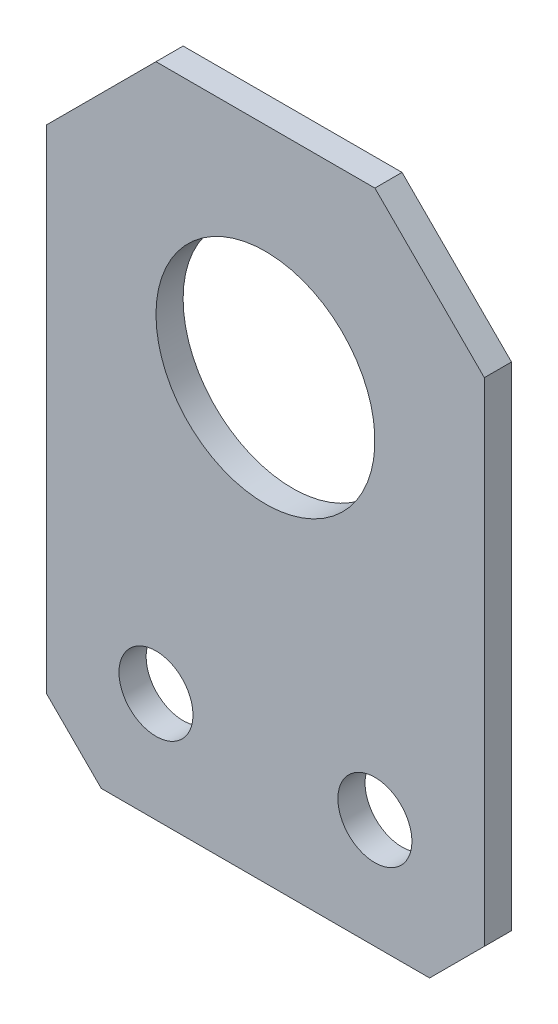
ISO-10303-21;
HEADER;
FILE_DESCRIPTION(('STEP AP214'),'2;1');
FILE_NAME('part.step','',(''),(''),'','','');
FILE_SCHEMA(('AUTOMOTIVE_DESIGN { 1 0 10303 214 1 1 1 1 }'));
ENDSEC;
DATA;
#1=APPLICATION_CONTEXT('core data for automotive mechanical design processes');
#2=APPLICATION_PROTOCOL_DEFINITION('international standard','automotive_design',2000,#1);
#3=PRODUCT_CONTEXT('',#1,'mechanical');
#4=PRODUCT('Part','Part','',(#3));
#5=PRODUCT_RELATED_PRODUCT_CATEGORY('part','',(#4));
#6=PRODUCT_DEFINITION_FORMATION('','',#4);
#7=PRODUCT_DEFINITION_CONTEXT('part definition',#1,'design');
#8=PRODUCT_DEFINITION('design','',#6,#7);
#9=PRODUCT_DEFINITION_SHAPE('','',#8);
#10=(LENGTH_UNIT() NAMED_UNIT(*) SI_UNIT(.MILLI.,.METRE.));
#11=(NAMED_UNIT(*) PLANE_ANGLE_UNIT() SI_UNIT($,.RADIAN.));
#12=(NAMED_UNIT(*) SI_UNIT($,.STERADIAN.) SOLID_ANGLE_UNIT());
#13=UNCERTAINTY_MEASURE_WITH_UNIT(LENGTH_MEASURE(1.E-05),#10,'distance_accuracy_value','');
#14=(GEOMETRIC_REPRESENTATION_CONTEXT(3) GLOBAL_UNCERTAINTY_ASSIGNED_CONTEXT((#13)) GLOBAL_UNIT_ASSIGNED_CONTEXT((#10,
#11,#12)) REPRESENTATION_CONTEXT('',''));
#15=CARTESIAN_POINT('',(0.,0.,0.));
#16=DIRECTION('',(0.,0.,1.));
#17=DIRECTION('',(1.,0.,0.));
#18=AXIS2_PLACEMENT_3D('',#15,#16,#17);
#19=CARTESIAN_POINT('',(-12.7,-25.4,0.));
#20=DIRECTION('',(0.,0.,1.));
#21=DIRECTION('',(1.,0.,0.));
#22=AXIS2_PLACEMENT_3D('',#19,#20,#21);
#23=PLANE('',#22);
#24=CARTESIAN_POINT('',(6.35,-19.05,0.));
#25=DIRECTION('',(0.,0.,-1.));
#26=DIRECTION('',(-1.,0.,0.));
#27=AXIS2_PLACEMENT_3D('',#24,#25,#26);
#28=CIRCLE('',#27,2.1463);
#29=CARTESIAN_POINT('',(4.2037,-19.05,0.));
#30=VERTEX_POINT('',#29);
#31=EDGE_CURVE('E115',#30,#30,#28,.F.);
#32=ORIENTED_EDGE('',*,*,#31,.T.);
#33=EDGE_LOOP('',(#32));
#34=FACE_BOUND('',#33,.T.);
#35=CARTESIAN_POINT('',(0.,0.,0.));
#36=DIRECTION('',(0.,0.,-1.));
#37=DIRECTION('',(-1.,0.,0.));
#38=AXIS2_PLACEMENT_3D('',#35,#36,#37);
#39=CIRCLE('',#38,6.35);
#40=CARTESIAN_POINT('',(-6.35,0.,0.));
#41=VERTEX_POINT('',#40);
#42=EDGE_CURVE('E117',#41,#41,#39,.F.);
#43=ORIENTED_EDGE('',*,*,#42,.T.);
#44=EDGE_LOOP('',(#43));
#45=FACE_BOUND('',#44,.T.);
#46=DIRECTION('',(-0.707106781186549,-0.707106781186546,0.));
#47=VECTOR('',#46,1.);
#48=CARTESIAN_POINT('',(12.7,-22.225,0.));
#49=LINE('',#48,#47);
#50=CARTESIAN_POINT('',(12.7,-22.225,0.));
#51=VERTEX_POINT('',#50);
#52=CARTESIAN_POINT('',(9.52499999999998,-25.4,0.));
#53=VERTEX_POINT('',#52);
#54=EDGE_CURVE('E82',#51,#53,#49,.T.);
#55=ORIENTED_EDGE('',*,*,#54,.T.);
#56=DIRECTION('',(1.,0.,0.));
#57=VECTOR('',#56,1.);
#58=CARTESIAN_POINT('',(-12.7,-25.4,0.));
#59=LINE('',#58,#57);
#60=CARTESIAN_POINT('',(-9.525,-25.4,0.));
#61=VERTEX_POINT('',#60);
#62=EDGE_CURVE('E85',#53,#61,#59,.F.);
#63=ORIENTED_EDGE('',*,*,#62,.T.);
#64=DIRECTION('',(-0.707106781186547,0.707106781186548,0.));
#65=VECTOR('',#64,1.);
#66=CARTESIAN_POINT('',(-9.525,-25.4,0.));
#67=LINE('',#66,#65);
#68=CARTESIAN_POINT('',(-12.7,-22.225,0.));
#69=VERTEX_POINT('',#68);
#70=EDGE_CURVE('E121',#61,#69,#67,.T.);
#71=ORIENTED_EDGE('',*,*,#70,.T.);
#72=DIRECTION('',(0.,1.,0.));
#73=VECTOR('',#72,1.);
#74=CARTESIAN_POINT('',(-12.7,12.7,0.));
#75=LINE('',#74,#73);
#76=CARTESIAN_POINT('',(-12.7,6.35,0.));
#77=VERTEX_POINT('',#76);
#78=EDGE_CURVE('E128',#69,#77,#75,.T.);
#79=ORIENTED_EDGE('',*,*,#78,.T.);
#80=DIRECTION('',(0.707106781186549,0.707106781186546,0.));
#81=VECTOR('',#80,1.);
#82=CARTESIAN_POINT('',(-12.7,6.35,0.));
#83=LINE('',#82,#81);
#84=CARTESIAN_POINT('',(-6.34999999999997,12.7,0.));
#85=VERTEX_POINT('',#84);
#86=EDGE_CURVE('E135',#77,#85,#83,.T.);
#87=ORIENTED_EDGE('',*,*,#86,.T.);
#88=DIRECTION('',(1.,0.,0.));
#89=VECTOR('',#88,1.);
#90=CARTESIAN_POINT('',(-12.7,12.7,0.));
#91=LINE('',#90,#89);
#92=CARTESIAN_POINT('',(6.35,12.7,0.));
#93=VERTEX_POINT('',#92);
#94=EDGE_CURVE('E139',#85,#93,#91,.T.);
#95=ORIENTED_EDGE('',*,*,#94,.T.);
#96=DIRECTION('',(0.707106781186546,-0.707106781186549,0.));
#97=VECTOR('',#96,1.);
#98=CARTESIAN_POINT('',(6.35,12.7,0.));
#99=LINE('',#98,#97);
#100=CARTESIAN_POINT('',(12.7,6.34999999999997,0.));
#101=VERTEX_POINT('',#100);
#102=EDGE_CURVE('E143',#93,#101,#99,.T.);
#103=ORIENTED_EDGE('',*,*,#102,.T.);
#104=DIRECTION('',(0.,-1.,0.));
#105=VECTOR('',#104,1.);
#106=CARTESIAN_POINT('',(12.7,12.7,0.));
#107=LINE('',#106,#105);
#108=EDGE_CURVE('E80',#101,#51,#107,.T.);
#109=ORIENTED_EDGE('',*,*,#108,.T.);
#110=EDGE_LOOP('',(#55,#63,#71,#79,#87,#95,#103,#109));
#111=FACE_BOUND('',#110,.T.);
#112=CARTESIAN_POINT('',(-6.35,-19.05,0.));
#113=DIRECTION('',(0.,0.,-1.));
#114=DIRECTION('',(-1.,0.,0.));
#115=AXIS2_PLACEMENT_3D('',#112,#113,#114);
#116=CIRCLE('',#115,2.1463);
#117=CARTESIAN_POINT('',(-8.4963,-19.05,0.));
#118=VERTEX_POINT('',#117);
#119=EDGE_CURVE('E20',#118,#118,#116,.F.);
#120=ORIENTED_EDGE('',*,*,#119,.T.);
#121=EDGE_LOOP('',(#120));
#122=FACE_BOUND('',#121,.T.);
#123=ADVANCED_FACE('F17',(#34,#45,#111,#122),#23,.F.);
#124=CARTESIAN_POINT('',(-6.35,-19.05,1.5748));
#125=DIRECTION('',(0.,0.,-1.));
#126=DIRECTION('',(-1.,0.,0.));
#127=AXIS2_PLACEMENT_3D('',#124,#125,#126);
#128=CYLINDRICAL_SURFACE('',#127,2.1463);
#129=CARTESIAN_POINT('',(-6.35,-19.05,1.5748));
#130=DIRECTION('',(0.,0.,-1.));
#131=DIRECTION('',(-1.,0.,0.));
#132=AXIS2_PLACEMENT_3D('',#129,#130,#131);
#133=CIRCLE('',#132,2.1463);
#134=CARTESIAN_POINT('',(-8.4963,-19.05,1.5748));
#135=VERTEX_POINT('',#134);
#136=EDGE_CURVE('E111',#135,#135,#133,.T.);
#137=ORIENTED_EDGE('',*,*,#136,.F.);
#138=EDGE_LOOP('',(#137));
#139=FACE_BOUND('',#138,.T.);
#140=ORIENTED_EDGE('',*,*,#119,.F.);
#141=EDGE_LOOP('',(#140));
#142=FACE_BOUND('',#141,.T.);
#143=ADVANCED_FACE('F283',(#139,#142),#128,.F.);
#144=CARTESIAN_POINT('',(-12.7,-25.4,1.5748));
#145=DIRECTION('',(0.,1.,0.));
#146=DIRECTION('',(0.,0.,1.));
#147=AXIS2_PLACEMENT_3D('',#144,#145,#146);
#148=PLANE('',#147);
#149=DIRECTION('',(0.,0.,1.));
#150=VECTOR('',#149,1.);
#151=CARTESIAN_POINT('',(9.52499999999999,-25.4,1.5748));
#152=LINE('',#151,#150);
#153=CARTESIAN_POINT('',(9.52499999999998,-25.4,1.5748));
#154=VERTEX_POINT('',#153);
#155=EDGE_CURVE('E90',#53,#154,#152,.T.);
#156=ORIENTED_EDGE('',*,*,#155,.T.);
#157=DIRECTION('',(1.,0.,0.));
#158=VECTOR('',#157,1.);
#159=CARTESIAN_POINT('',(-12.7,-25.4,1.5748));
#160=LINE('',#159,#158);
#161=CARTESIAN_POINT('',(-9.525,-25.4,1.5748));
#162=VERTEX_POINT('',#161);
#163=EDGE_CURVE('E114',#162,#154,#160,.T.);
#164=ORIENTED_EDGE('',*,*,#163,.F.);
#165=DIRECTION('',(0.,0.,1.));
#166=VECTOR('',#165,1.);
#167=CARTESIAN_POINT('',(-9.525,-25.4,1.5748));
#168=LINE('',#167,#166);
#169=EDGE_CURVE('E96',#162,#61,#168,.F.);
#170=ORIENTED_EDGE('',*,*,#169,.T.);
#171=ORIENTED_EDGE('',*,*,#62,.F.);
#172=EDGE_LOOP('',(#156,#164,#170,#171));
#173=FACE_BOUND('',#172,.T.);
#174=ADVANCED_FACE('F93',(#173),#148,.F.);
#175=CARTESIAN_POINT('',(12.7,-22.225,1.5748));
#176=DIRECTION('',(-0.707106781186546,0.707106781186549,0.));
#177=DIRECTION('',(-0.707106781186549,-0.707106781186546,0.));
#178=AXIS2_PLACEMENT_3D('',#175,#176,#177);
#179=PLANE('',#178);
#180=ORIENTED_EDGE('',*,*,#155,.F.);
#181=ORIENTED_EDGE('',*,*,#54,.F.);
#182=DIRECTION('',(0.,0.,1.));
#183=VECTOR('',#182,1.);
#184=CARTESIAN_POINT('',(12.7,-22.225,1.5748));
#185=LINE('',#184,#183);
#186=CARTESIAN_POINT('',(12.7,-22.225,1.5748));
#187=VERTEX_POINT('',#186);
#188=EDGE_CURVE('E104',#51,#187,#185,.T.);
#189=ORIENTED_EDGE('',*,*,#188,.T.);
#190=DIRECTION('',(0.707106781186549,0.707106781186546,0.));
#191=VECTOR('',#190,1.);
#192=CARTESIAN_POINT('',(9.52499999999998,-25.4,1.5748));
#193=LINE('',#192,#191);
#194=EDGE_CURVE('E101',#154,#187,#193,.T.);
#195=ORIENTED_EDGE('',*,*,#194,.F.);
#196=EDGE_LOOP('',(#180,#181,#189,#195));
#197=FACE_BOUND('',#196,.T.);
#198=ADVANCED_FACE('F99',(#197),#179,.F.);
#199=CARTESIAN_POINT('',(12.7,12.7,1.5748));
#200=DIRECTION('',(-1.,0.,0.));
#201=DIRECTION('',(0.,-1.,0.));
#202=AXIS2_PLACEMENT_3D('',#199,#200,#201);
#203=PLANE('',#202);
#204=ORIENTED_EDGE('',*,*,#188,.F.);
#205=ORIENTED_EDGE('',*,*,#108,.F.);
#206=DIRECTION('',(0.,0.,1.));
#207=VECTOR('',#206,1.);
#208=CARTESIAN_POINT('',(12.7,6.34999999999997,1.5748));
#209=LINE('',#208,#207);
#210=CARTESIAN_POINT('',(12.7,6.34999999999997,1.5748));
#211=VERTEX_POINT('',#210);
#212=EDGE_CURVE('E141',#101,#211,#209,.T.);
#213=ORIENTED_EDGE('',*,*,#212,.T.);
#214=DIRECTION('',(0.,1.,0.));
#215=VECTOR('',#214,1.);
#216=CARTESIAN_POINT('',(12.7,-25.4,1.5748));
#217=LINE('',#216,#215);
#218=EDGE_CURVE('E147',#187,#211,#217,.T.);
#219=ORIENTED_EDGE('',*,*,#218,.F.);
#220=EDGE_LOOP('',(#204,#205,#213,#219));
#221=FACE_BOUND('',#220,.T.);
#222=ADVANCED_FACE('F148',(#221),#203,.F.);
#223=CARTESIAN_POINT('',(6.35,12.7,1.5748));
#224=DIRECTION('',(-0.707106781186549,-0.707106781186546,0.));
#225=DIRECTION('',(0.707106781186546,-0.707106781186549,0.));
#226=AXIS2_PLACEMENT_3D('',#223,#224,#225);
#227=PLANE('',#226);
#228=ORIENTED_EDGE('',*,*,#212,.F.);
#229=ORIENTED_EDGE('',*,*,#102,.F.);
#230=DIRECTION('',(0.,0.,-1.));
#231=VECTOR('',#230,1.);
#232=CARTESIAN_POINT('',(6.35,12.7,1.5748));
#233=LINE('',#232,#231);
#234=CARTESIAN_POINT('',(6.35,12.7,1.5748));
#235=VERTEX_POINT('',#234);
#236=EDGE_CURVE('E137',#93,#235,#233,.F.);
#237=ORIENTED_EDGE('',*,*,#236,.T.);
#238=DIRECTION('',(-0.707106781186546,0.707106781186549,0.));
#239=VECTOR('',#238,1.);
#240=CARTESIAN_POINT('',(12.7,6.34999999999997,1.5748));
#241=LINE('',#240,#239);
#242=EDGE_CURVE('E153',#211,#235,#241,.T.);
#243=ORIENTED_EDGE('',*,*,#242,.F.);
#244=EDGE_LOOP('',(#228,#229,#237,#243));
#245=FACE_BOUND('',#244,.T.);
#246=ADVANCED_FACE('F184',(#245),#227,.F.);
#247=CARTESIAN_POINT('',(-12.7,12.7,1.5748));
#248=DIRECTION('',(0.,-1.,0.));
#249=DIRECTION('',(0.,0.,-1.));
#250=AXIS2_PLACEMENT_3D('',#247,#248,#249);
#251=PLANE('',#250);
#252=ORIENTED_EDGE('',*,*,#236,.F.);
#253=ORIENTED_EDGE('',*,*,#94,.F.);
#254=DIRECTION('',(0.,0.,1.));
#255=VECTOR('',#254,1.);
#256=CARTESIAN_POINT('',(-6.34999999999997,12.7,1.5748));
#257=LINE('',#256,#255);
#258=CARTESIAN_POINT('',(-6.34999999999997,12.7,1.5748));
#259=VERTEX_POINT('',#258);
#260=EDGE_CURVE('E133',#85,#259,#257,.T.);
#261=ORIENTED_EDGE('',*,*,#260,.T.);
#262=DIRECTION('',(1.,0.,0.));
#263=VECTOR('',#262,1.);
#264=CARTESIAN_POINT('',(-12.7,12.7,1.5748));
#265=LINE('',#264,#263);
#266=EDGE_CURVE('E161',#235,#259,#265,.F.);
#267=ORIENTED_EDGE('',*,*,#266,.F.);
#268=EDGE_LOOP('',(#252,#253,#261,#267));
#269=FACE_BOUND('',#268,.T.);
#270=ADVANCED_FACE('F181',(#269),#251,.F.);
#271=CARTESIAN_POINT('',(-12.7,6.35,1.5748));
#272=DIRECTION('',(0.707106781186546,-0.707106781186549,0.));
#273=DIRECTION('',(0.707106781186549,0.707106781186546,0.));
#274=AXIS2_PLACEMENT_3D('',#271,#272,#273);
#275=PLANE('',#274);
#276=ORIENTED_EDGE('',*,*,#260,.F.);
#277=ORIENTED_EDGE('',*,*,#86,.F.);
#278=DIRECTION('',(0.,0.,1.));
#279=VECTOR('',#278,1.);
#280=CARTESIAN_POINT('',(-12.7,6.35,1.5748));
#281=LINE('',#280,#279);
#282=CARTESIAN_POINT('',(-12.7,6.35000000000001,1.5748));
#283=VERTEX_POINT('',#282);
#284=EDGE_CURVE('E131',#77,#283,#281,.T.);
#285=ORIENTED_EDGE('',*,*,#284,.T.);
#286=DIRECTION('',(-0.70710678118655,-0.707106781186545,0.));
#287=VECTOR('',#286,1.);
#288=CARTESIAN_POINT('',(-6.34999999999997,12.7,1.5748));
#289=LINE('',#288,#287);
#290=EDGE_CURVE('E164',#259,#283,#289,.T.);
#291=ORIENTED_EDGE('',*,*,#290,.F.);
#292=EDGE_LOOP('',(#276,#277,#285,#291));
#293=FACE_BOUND('',#292,.T.);
#294=ADVANCED_FACE('F176',(#293),#275,.F.);
#295=CARTESIAN_POINT('',(-12.7,12.7,1.5748));
#296=DIRECTION('',(1.,0.,0.));
#297=DIRECTION('',(0.,1.,0.));
#298=AXIS2_PLACEMENT_3D('',#295,#296,#297);
#299=PLANE('',#298);
#300=DIRECTION('',(0.,0.,1.));
#301=VECTOR('',#300,1.);
#302=CARTESIAN_POINT('',(-12.7,-22.225,1.5748));
#303=LINE('',#302,#301);
#304=CARTESIAN_POINT('',(-12.7,-22.225,1.5748));
#305=VERTEX_POINT('',#304);
#306=EDGE_CURVE('E35',#69,#305,#303,.T.);
#307=ORIENTED_EDGE('',*,*,#306,.T.);
#308=DIRECTION('',(0.,1.,0.));
#309=VECTOR('',#308,1.);
#310=CARTESIAN_POINT('',(-12.7,-25.4,1.5748));
#311=LINE('',#310,#309);
#312=EDGE_CURVE('E167',#283,#305,#311,.F.);
#313=ORIENTED_EDGE('',*,*,#312,.F.);
#314=ORIENTED_EDGE('',*,*,#284,.F.);
#315=ORIENTED_EDGE('',*,*,#78,.F.);
#316=EDGE_LOOP('',(#307,#313,#314,#315));
#317=FACE_BOUND('',#316,.T.);
#318=ADVANCED_FACE('F172',(#317),#299,.F.);
#319=CARTESIAN_POINT('',(-9.525,-25.4,1.5748));
#320=DIRECTION('',(0.707106781186548,0.707106781186547,0.));
#321=DIRECTION('',(-0.707106781186547,0.707106781186548,0.));
#322=AXIS2_PLACEMENT_3D('',#319,#320,#321);
#323=PLANE('',#322);
#324=ORIENTED_EDGE('',*,*,#306,.F.);
#325=ORIENTED_EDGE('',*,*,#70,.F.);
#326=ORIENTED_EDGE('',*,*,#169,.F.);
#327=DIRECTION('',(0.707106781186547,-0.707106781186548,0.));
#328=VECTOR('',#327,1.);
#329=CARTESIAN_POINT('',(-12.7,-22.225,1.5748));
#330=LINE('',#329,#328);
#331=EDGE_CURVE('E110',#305,#162,#330,.T.);
#332=ORIENTED_EDGE('',*,*,#331,.F.);
#333=EDGE_LOOP('',(#324,#325,#326,#332));
#334=FACE_BOUND('',#333,.T.);
#335=ADVANCED_FACE('F170',(#334),#323,.F.);
#336=CARTESIAN_POINT('',(0.,0.,1.5748));
#337=DIRECTION('',(0.,0.,-1.));
#338=DIRECTION('',(-1.,0.,0.));
#339=AXIS2_PLACEMENT_3D('',#336,#337,#338);
#340=CYLINDRICAL_SURFACE('',#339,6.35);
#341=CARTESIAN_POINT('',(0.,0.,1.5748));
#342=DIRECTION('',(0.,0.,-1.));
#343=DIRECTION('',(-1.,0.,0.));
#344=AXIS2_PLACEMENT_3D('',#341,#342,#343);
#345=CIRCLE('',#344,6.35);
#346=CARTESIAN_POINT('',(-6.35,0.,1.5748));
#347=VERTEX_POINT('',#346);
#348=EDGE_CURVE('E26',#347,#347,#345,.T.);
#349=ORIENTED_EDGE('',*,*,#348,.F.);
#350=EDGE_LOOP('',(#349));
#351=FACE_BOUND('',#350,.T.);
#352=ORIENTED_EDGE('',*,*,#42,.F.);
#353=EDGE_LOOP('',(#352));
#354=FACE_BOUND('',#353,.T.);
#355=ADVANCED_FACE('F201',(#351,#354),#340,.F.);
#356=CARTESIAN_POINT('',(6.35,-19.05,1.5748));
#357=DIRECTION('',(0.,0.,-1.));
#358=DIRECTION('',(-1.,0.,0.));
#359=AXIS2_PLACEMENT_3D('',#356,#357,#358);
#360=CYLINDRICAL_SURFACE('',#359,2.1463);
#361=CARTESIAN_POINT('',(6.35,-19.05,1.5748));
#362=DIRECTION('',(0.,0.,-1.));
#363=DIRECTION('',(-1.,0.,0.));
#364=AXIS2_PLACEMENT_3D('',#361,#362,#363);
#365=CIRCLE('',#364,2.1463);
#366=CARTESIAN_POINT('',(4.2037,-19.05,1.5748));
#367=VERTEX_POINT('',#366);
#368=EDGE_CURVE('E11',#367,#367,#365,.T.);
#369=ORIENTED_EDGE('',*,*,#368,.F.);
#370=EDGE_LOOP('',(#369));
#371=FACE_BOUND('',#370,.T.);
#372=ORIENTED_EDGE('',*,*,#31,.F.);
#373=EDGE_LOOP('',(#372));
#374=FACE_BOUND('',#373,.T.);
#375=ADVANCED_FACE('F195',(#371,#374),#360,.F.);
#376=CARTESIAN_POINT('',(-12.7,-25.4,1.5748));
#377=DIRECTION('',(0.,0.,1.));
#378=DIRECTION('',(1.,0.,0.));
#379=AXIS2_PLACEMENT_3D('',#376,#377,#378);
#380=PLANE('',#379);
#381=ORIENTED_EDGE('',*,*,#368,.T.);
#382=EDGE_LOOP('',(#381));
#383=FACE_BOUND('',#382,.T.);
#384=ORIENTED_EDGE('',*,*,#348,.T.);
#385=EDGE_LOOP('',(#384));
#386=FACE_BOUND('',#385,.T.);
#387=ORIENTED_EDGE('',*,*,#312,.T.);
#388=ORIENTED_EDGE('',*,*,#331,.T.);
#389=ORIENTED_EDGE('',*,*,#163,.T.);
#390=ORIENTED_EDGE('',*,*,#194,.T.);
#391=ORIENTED_EDGE('',*,*,#218,.T.);
#392=ORIENTED_EDGE('',*,*,#242,.T.);
#393=ORIENTED_EDGE('',*,*,#266,.T.);
#394=ORIENTED_EDGE('',*,*,#290,.T.);
#395=EDGE_LOOP('',(#387,#388,#389,#390,#391,#392,#393,#394));
#396=FACE_BOUND('',#395,.T.);
#397=ORIENTED_EDGE('',*,*,#136,.T.);
#398=EDGE_LOOP('',(#397));
#399=FACE_BOUND('',#398,.T.);
#400=ADVANCED_FACE('F156',(#383,#386,#396,#399),#380,.T.);
#401=CLOSED_SHELL('',(#123,#143,#174,#198,#222,#246,#270,#294,#318,#335,#355,#375,#400));
#402=MANIFOLD_SOLID_BREP('B1',#401);
#403=ADVANCED_BREP_SHAPE_REPRESENTATION('',(#18,#402),#14);
#404=SHAPE_DEFINITION_REPRESENTATION(#9,#403);
ENDSEC;
END-ISO-10303-21;
